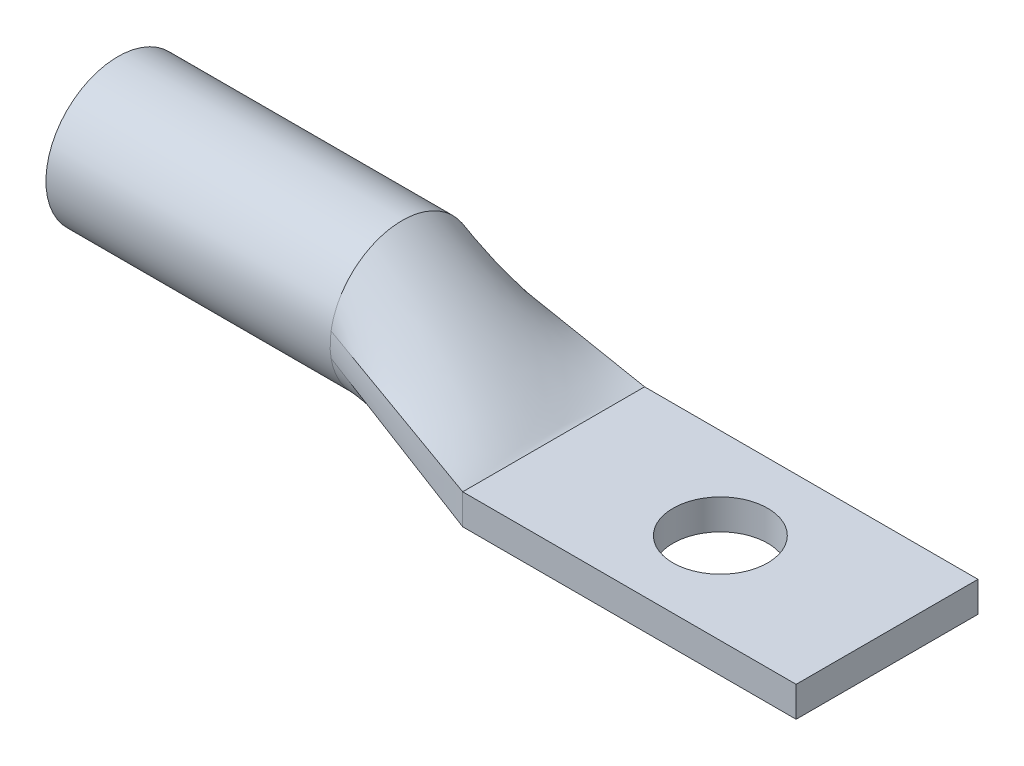
ISO-10303-21;
HEADER;
FILE_DESCRIPTION(('STEP AP214'),'2;1');
FILE_NAME('part.step','',(''),(''),'','','');
FILE_SCHEMA(('AUTOMOTIVE_DESIGN { 1 0 10303 214 1 1 1 1 }'));
ENDSEC;
DATA;
#1=APPLICATION_CONTEXT('core data for automotive mechanical design processes');
#2=APPLICATION_PROTOCOL_DEFINITION('international standard','automotive_design',2000,#1);
#3=PRODUCT_CONTEXT('',#1,'mechanical');
#4=PRODUCT('Part','Part','',(#3));
#5=PRODUCT_RELATED_PRODUCT_CATEGORY('part','',(#4));
#6=PRODUCT_DEFINITION_FORMATION('','',#4);
#7=PRODUCT_DEFINITION_CONTEXT('part definition',#1,'design');
#8=PRODUCT_DEFINITION('design','',#6,#7);
#9=PRODUCT_DEFINITION_SHAPE('','',#8);
#10=(LENGTH_UNIT() NAMED_UNIT(*) SI_UNIT(.MILLI.,.METRE.));
#11=(NAMED_UNIT(*) PLANE_ANGLE_UNIT() SI_UNIT($,.RADIAN.));
#12=(NAMED_UNIT(*) SI_UNIT($,.STERADIAN.) SOLID_ANGLE_UNIT());
#13=UNCERTAINTY_MEASURE_WITH_UNIT(LENGTH_MEASURE(1.E-05),#10,'distance_accuracy_value','');
#14=(GEOMETRIC_REPRESENTATION_CONTEXT(3) GLOBAL_UNCERTAINTY_ASSIGNED_CONTEXT((#13)) GLOBAL_UNIT_ASSIGNED_CONTEXT((#10,
#11,#12)) REPRESENTATION_CONTEXT('',''));
#15=CARTESIAN_POINT('',(0.,0.,0.));
#16=DIRECTION('',(0.,0.,1.));
#17=DIRECTION('',(1.,0.,0.));
#18=AXIS2_PLACEMENT_3D('',#15,#16,#17);
#19=CARTESIAN_POINT('',(19.05,0.,0.));
#20=DIRECTION('',(-1.,0.,0.));
#21=DIRECTION('',(0.,0.,1.));
#22=AXIS2_PLACEMENT_3D('',#19,#20,#21);
#23=CYLINDRICAL_SURFACE('',#22,4.826);
#24=CARTESIAN_POINT('',(19.05,0.793389512735654,-4.76033707641393));
#25=CARTESIAN_POINT('',(19.05,1.18468681003295,-4.69512086019771));
#26=CARTESIAN_POINT('',(19.05,1.61085234995865,-4.57504836332163));
#27=CARTESIAN_POINT('',(19.05,2.48972983893217,-4.16259031724598));
#28=CARTESIAN_POINT('',(19.05,2.9428198836875,-3.86831403633024));
#29=CARTESIAN_POINT('',(19.05,3.77274035984854,-3.06438779019007));
#30=CARTESIAN_POINT('',(19.05,4.14731721956046,-2.55250883358654));
#31=CARTESIAN_POINT('',(19.05,4.54385567654352,-1.65830273383458));
#32=CARTESIAN_POINT('',(19.05,4.6484134489801,-1.34016259708065));
#33=CARTESIAN_POINT('',(19.05,4.78953327401909,-0.681288776024551));
#34=CARTESIAN_POINT('',(19.05,4.826,-0.340686277378045));
#35=CARTESIAN_POINT('',(19.05,4.826,0.340686277378045));
#36=CARTESIAN_POINT('',(19.05,4.78953327401909,0.681288776024549));
#37=CARTESIAN_POINT('',(19.05,4.6484134489801,1.34016259708065));
#38=CARTESIAN_POINT('',(19.05,4.54385567654352,1.65830273383458));
#39=CARTESIAN_POINT('',(19.05,4.14731721956046,2.55250883358654));
#40=CARTESIAN_POINT('',(19.05,3.77274035984854,3.06438779019007));
#41=CARTESIAN_POINT('',(19.05,2.9428198836875,3.86831403633024));
#42=CARTESIAN_POINT('',(19.05,2.48972983893217,4.16259031724598));
#43=CARTESIAN_POINT('',(19.05,1.61085234995865,4.57504836332163));
#44=CARTESIAN_POINT('',(19.05,1.18468681003295,4.69512086019771));
#45=CARTESIAN_POINT('',(19.05,0.793389512735655,4.76033707641393));
#46=B_SPLINE_CURVE_WITH_KNOTS('',3,(#24,#25,#26,#27,#28,#29,#30,#31,#32,#33,#34,#35,#36,#37,#38,
#39,#40,#41,#42,#43,#44,#45),.UNSPECIFIED.,.F.,.F.,(4,2,2,2,2,2,2,2,2,2,4),(0.,0.125,0.25,0.375,
0.4375,0.5,0.5625,0.625,0.75,0.875,1.),.UNSPECIFIED.);
#47=CARTESIAN_POINT('',(19.05,0.793389512735655,-4.76033707641393));
#48=VERTEX_POINT('',#47);
#49=CARTESIAN_POINT('',(19.05,0.793391656333842,4.76034985110768));
#50=VERTEX_POINT('',#49);
#51=EDGE_CURVE('E13',#48,#50,#46,.T.);
#52=ORIENTED_EDGE('',*,*,#51,.F.);
#53=CARTESIAN_POINT('',(19.0499999999992,-0.793389530404539,-4.76033707346888));
#54=CARTESIAN_POINT('',(19.0499999553236,-0.70971940892889,-4.77428428292741));
#55=CARTESIAN_POINT('',(19.050313283054,-0.625682963095867,-4.78602102616122));
#56=CARTESIAN_POINT('',(19.0511964116202,-0.457106966634893,-4.80505138351904));
#57=CARTESIAN_POINT('',(19.0517662204116,-0.372567400481545,-4.81234485980635));
#58=CARTESIAN_POINT('',(19.0528223453544,-0.198209054157865,-4.82276508467764));
#59=CARTESIAN_POINT('',(19.0533017249978,-0.10837392405302,-4.8256197096395));
#60=CARTESIAN_POINT('',(19.0537578511973,0.0713231323465182,-4.82630917731358));
#61=CARTESIAN_POINT('',(19.0537345924902,0.161185058911953,-4.82414396746164));
#62=CARTESIAN_POINT('',(19.0532343312005,0.296344132059458,-4.8171077835285));
#63=CARTESIAN_POINT('',(19.0529869402001,0.341746553379283,-4.81409967309325));
#64=CARTESIAN_POINT('',(19.0523761546005,0.432448906192598,-4.80680077283046));
#65=CARTESIAN_POINT('',(19.052012759414,0.477748837166023,-4.80250997650884));
#66=CARTESIAN_POINT('',(19.0512534752478,0.568210320025473,-4.79264887790791));
#67=CARTESIAN_POINT('',(19.0508575851155,0.613371866944239,-4.7870785302322));
#68=CARTESIAN_POINT('',(19.0502432393321,0.703520288257333,-4.77466289335629));
#69=CARTESIAN_POINT('',(19.0500247830931,0.748507163229855,-4.76781760838003));
#70=CARTESIAN_POINT('',(19.05,0.793389512735655,-4.76033707641393));
#71=B_SPLINE_CURVE_WITH_KNOTS('',3,(#53,#54,#55,#56,#57,#58,#59,#60,#61,#62,#63,#64,#65,#66,#67,
#68,#69,#70),.UNSPECIFIED.,.F.,.F.,(4,2,2,2,2,2,2,2,4),(0.,0.254440838803736,0.508889570336781,
0.778396220456408,1.04790569267245,1.18439838796632,1.32089177431771,1.45739000398038,
1.59388778142562),.UNSPECIFIED.);
#72=CARTESIAN_POINT('',(19.05,-0.793391849598439,-4.76035098860972));
#73=VERTEX_POINT('',#72);
#74=EDGE_CURVE('E78',#73,#48,#71,.T.);
#75=ORIENTED_EDGE('',*,*,#74,.F.);
#76=CARTESIAN_POINT('',(19.05,0.,0.));
#77=DIRECTION('',(1.,0.,0.));
#78=DIRECTION('',(0.,0.,-1.));
#79=AXIS2_PLACEMENT_3D('',#76,#77,#78);
#80=CIRCLE('',#79,4.826);
#81=CARTESIAN_POINT('',(19.05,-0.793390031725335,4.76034008807513));
#82=VERTEX_POINT('',#81);
#83=EDGE_CURVE('E82',#82,#73,#80,.T.);
#84=ORIENTED_EDGE('',*,*,#83,.F.);
#85=CARTESIAN_POINT('',(19.05,0.793389526826757,4.76033707406541));
#86=CARTESIAN_POINT('',(19.0500192082532,0.751553142443878,4.76730990862543));
#87=CARTESIAN_POINT('',(19.0502115622753,0.709625926892214,4.7737308308762));
#88=CARTESIAN_POINT('',(19.05076404498,0.625618044641488,4.78546513617494));
#89=CARTESIAN_POINT('',(19.0511241726152,0.583537378902092,4.79077852613729));
#90=CARTESIAN_POINT('',(19.0518336922892,0.499250056063873,4.80029416520852));
#91=CARTESIAN_POINT('',(19.0521830842699,0.45704339828372,4.80449640829759));
#92=CARTESIAN_POINT('',(19.0527933583929,0.372534409972693,4.81178689971965));
#93=CARTESIAN_POINT('',(19.0530542402312,0.330232079113643,4.81487514422558));
#94=CARTESIAN_POINT('',(19.0536592548741,0.198212538373395,4.82276447994064));
#95=CARTESIAN_POINT('',(19.053770281145,0.108369498135098,4.82561943858651));
#96=CARTESIAN_POINT('',(19.0534515060578,-0.0713307979335069,4.82630949478189));
#97=CARTESIAN_POINT('',(19.0530216913107,-0.161188054060678,4.82414446805582));
#98=CARTESIAN_POINT('',(19.051969904612,-0.341787322490946,4.81474141245036));
#99=CARTESIAN_POINT('',(19.0513455502482,-0.432525990303786,4.80743899161503));
#100=CARTESIAN_POINT('',(19.0503610245987,-0.613447257436715,4.78771832679719));
#101=CARTESIAN_POINT('',(19.0500008544522,-0.703629854357454,4.77530006075634));
#102=CARTESIAN_POINT('',(19.05,-0.793389529321084,4.76033707364969));
#103=B_SPLINE_CURVE_WITH_KNOTS('',3,(#85,#86,#87,#88,#89,#90,#91,#92,#93,#94,#95,#96,#97,#98,
#99,#100,#101,#102),.UNSPECIFIED.,.F.,.F.,(4,2,2,2,2,2,2,2,4),(0.,0.127234934895088,
0.25446907543118,0.381703905263918,0.508939172197092,0.778448562686817,1.04796462526658,
1.32092040853963,1.59387736874754),.UNSPECIFIED.);
#104=EDGE_CURVE('E154',#50,#82,#103,.T.);
#105=ORIENTED_EDGE('',*,*,#104,.F.);
#106=EDGE_LOOP('',(#52,#75,#84,#105));
#107=FACE_BOUND('',#106,.T.);
#108=CARTESIAN_POINT('',(0.,0.,0.));
#109=DIRECTION('',(1.,0.,0.));
#110=DIRECTION('',(0.,0.,-1.));
#111=AXIS2_PLACEMENT_3D('',#108,#109,#110);
#112=CIRCLE('',#111,4.826);
#113=CARTESIAN_POINT('',(0.,0.,-4.826));
#114=VERTEX_POINT('',#113);
#115=EDGE_CURVE('E71',#114,#114,#112,.T.);
#116=ORIENTED_EDGE('',*,*,#115,.T.);
#117=EDGE_LOOP('',(#116));
#118=FACE_BOUND('',#117,.T.);
#119=ADVANCED_FACE('F62',(#107,#118),#23,.T.);
#120=CARTESIAN_POINT('',(0.,0.,0.));
#121=DIRECTION('',(1.,0.,0.));
#122=DIRECTION('',(0.,0.,-1.));
#123=AXIS2_PLACEMENT_3D('',#120,#121,#122);
#124=PLANE('',#123);
#125=CARTESIAN_POINT('',(0.,0.,0.));
#126=DIRECTION('',(-1.,0.,0.));
#127=DIRECTION('',(0.,0.,1.));
#128=AXIS2_PLACEMENT_3D('',#125,#126,#127);
#129=CIRCLE('',#128,3.556);
#130=CARTESIAN_POINT('',(0.,0.,3.556));
#131=VERTEX_POINT('',#130);
#132=EDGE_CURVE('E477',#131,#131,#129,.T.);
#133=ORIENTED_EDGE('',*,*,#132,.F.);
#134=EDGE_LOOP('',(#133));
#135=FACE_BOUND('',#134,.T.);
#136=ORIENTED_EDGE('',*,*,#115,.F.);
#137=EDGE_LOOP('',(#136));
#138=FACE_BOUND('',#137,.T.);
#139=ADVANCED_FACE('F177',(#135,#138),#124,.F.);
#140=CARTESIAN_POINT('',(19.05,0.793389512735655,4.76033707641393));
#141=CARTESIAN_POINT('',(29.21,-2.794,6.096));
#142=CARTESIAN_POINT('',(19.05,0.53252464787079,4.8038145538914));
#143=CARTESIAN_POINT('',(29.21,-3.13266666666667,6.096));
#144=CARTESIAN_POINT('',(19.05,0.266262323935395,4.82555329263014));
#145=CARTESIAN_POINT('',(29.21,-3.47133333333333,6.096));
#146=CARTESIAN_POINT('',(19.05,-0.266262323935394,4.82555329263014));
#147=CARTESIAN_POINT('',(29.21,-4.14866666666667,6.096));
#148=CARTESIAN_POINT('',(19.05,-0.532524647870789,4.8038145538914));
#149=CARTESIAN_POINT('',(29.21,-4.48733333333333,6.096));
#150=CARTESIAN_POINT('',(19.05,-0.793389512735654,4.76033707641393));
#151=CARTESIAN_POINT('',(29.21,-4.826,6.096));
#152=CARTESIAN_POINT('',(19.05,-0.798606810032951,4.75946752686438));
#153=CARTESIAN_POINT('',(29.21,-4.83277333333333,6.096));
#154=CARTESIAN_POINT('',(19.05,-0.803824107330249,4.75859797731483));
#155=CARTESIAN_POINT('',(29.21,-4.83954666666667,6.096));
#156=CARTESIAN_POINT('',(19.05,-0.809041404627546,4.75772842776528));
#157=CARTESIAN_POINT('',(29.21,-4.84632,6.096));
#158=B_SPLINE_SURFACE_WITH_KNOTS('',3,1,((#140,#141),(#142,#143),(#144,#145),(#146,#147),(#148,
#149),(#150,#151),(#152,#153),(#154,#155),(#156,#157)),.UNSPECIFIED.,.F.,.F.,.F.,(4,2,3,4),(2,
2),(0.,0.5,1.,1.01),(0.,1.),.UNSPECIFIED.);
#159=DIRECTION('',(0.922601713042873,-0.366190289722907,0.121287883990981));
#160=VECTOR('',#159,1.);
#161=CARTESIAN_POINT('',(24.13,-2.80969475636783,5.42816853820696));
#162=LINE('',#161,#160);
#163=CARTESIAN_POINT('',(29.21,-4.826,6.096));
#164=VERTEX_POINT('',#163);
#165=EDGE_CURVE('E211',#82,#164,#162,.T.);
#166=DIRECTION('',(0.,1.,0.));
#167=VECTOR('',#166,1.);
#168=CARTESIAN_POINT('',(29.21,-4.826,6.096));
#169=LINE('',#168,#167);
#170=CARTESIAN_POINT('',(29.21,-2.794,6.096));
#171=VERTEX_POINT('',#170);
#172=EDGE_CURVE('E219',#164,#171,#169,.T.);
#173=DIRECTION('',(-0.935783885153291,0.330415481868695,-0.123020850382734));
#174=VECTOR('',#173,1.);
#175=CARTESIAN_POINT('',(24.13,-1.00030524363217,5.42816853820696));
#176=LINE('',#175,#174);
#177=EDGE_CURVE('E157',#171,#50,#176,.T.);
#178=ORIENTED_EDGE('',*,*,#104,.T.);
#179=ORIENTED_EDGE('',*,*,#165,.T.);
#180=ORIENTED_EDGE('',*,*,#172,.T.);
#181=ORIENTED_EDGE('',*,*,#177,.T.);
#182=EDGE_LOOP('',(#178,#179,#180,#181));
#183=FACE_BOUND('',#182,.T.);
#184=ADVANCED_FACE('F225',(#183),#158,.T.);
#185=CARTESIAN_POINT('',(19.05,-0.793389512735654,4.76033707641393));
#186=CARTESIAN_POINT('',(29.21,-4.826,6.096));
#187=CARTESIAN_POINT('',(19.05,-1.18468681003295,4.69512086019771));
#188=CARTESIAN_POINT('',(29.21,-4.826,5.588));
#189=CARTESIAN_POINT('',(19.05,-1.61085234995865,4.57504836332163));
#190=CARTESIAN_POINT('',(29.21,-4.826,5.08));
#191=CARTESIAN_POINT('',(19.05,-2.48972983893217,4.16259031724599));
#192=CARTESIAN_POINT('',(29.21,-4.826,4.064));
#193=CARTESIAN_POINT('',(19.05,-2.9428198836875,3.86831403633024));
#194=CARTESIAN_POINT('',(29.21,-4.826,3.556));
#195=CARTESIAN_POINT('',(19.05,-3.77274035984854,3.06438779019007));
#196=CARTESIAN_POINT('',(29.21,-4.826,2.54000000000001));
#197=CARTESIAN_POINT('',(19.05,-4.14731721956046,2.55250883358654));
#198=CARTESIAN_POINT('',(29.21,-4.826,2.03200000000001));
#199=CARTESIAN_POINT('',(19.05,-4.54385567654352,1.65830273383458));
#200=CARTESIAN_POINT('',(29.21,-4.826,1.27000000000001));
#201=CARTESIAN_POINT('',(19.05,-4.6484134489801,1.34016259708065));
#202=CARTESIAN_POINT('',(29.21,-4.826,1.01600000000001));
#203=CARTESIAN_POINT('',(19.05,-4.78953327401909,0.681288776024551));
#204=CARTESIAN_POINT('',(29.21,-4.826,0.508000000000007));
#205=CARTESIAN_POINT('',(19.05,-4.826,0.340686277378046));
#206=CARTESIAN_POINT('',(29.21,-4.826,0.254000000000007));
#207=CARTESIAN_POINT('',(19.05,-4.826,-0.340686277378043));
#208=CARTESIAN_POINT('',(29.21,-4.826,-0.253999999999993));
#209=CARTESIAN_POINT('',(19.05,-4.78953327401909,-0.681288776024548));
#210=CARTESIAN_POINT('',(29.21,-4.826,-0.507999999999992));
#211=CARTESIAN_POINT('',(19.05,-4.6484134489801,-1.34016259708065));
#212=CARTESIAN_POINT('',(29.21,-4.826,-1.01599999999999));
#213=CARTESIAN_POINT('',(19.05,-4.54385567654352,-1.65830273383458));
#214=CARTESIAN_POINT('',(29.21,-4.826,-1.26999999999999));
#215=CARTESIAN_POINT('',(19.05,-4.14731721956046,-2.55250883358654));
#216=CARTESIAN_POINT('',(29.21,-4.826,-2.03199999999999));
#217=CARTESIAN_POINT('',(19.05,-3.77274035984854,-3.06438779019007));
#218=CARTESIAN_POINT('',(29.21,-4.826,-2.53999999999999));
#219=CARTESIAN_POINT('',(19.05,-2.9428198836875,-3.86831403633024));
#220=CARTESIAN_POINT('',(29.21,-4.826,-3.55599999999999));
#221=CARTESIAN_POINT('',(19.05,-2.48972983893217,-4.16259031724599));
#222=CARTESIAN_POINT('',(29.21,-4.826,-4.06399999999999));
#223=CARTESIAN_POINT('',(19.05,-1.61085234995865,-4.57504836332163));
#224=CARTESIAN_POINT('',(29.21,-4.826,-5.07999999999999));
#225=CARTESIAN_POINT('',(19.05,-1.18468681003295,-4.69512086019771));
#226=CARTESIAN_POINT('',(29.21,-4.826,-5.588));
#227=CARTESIAN_POINT('',(19.05,-0.793389512735656,-4.76033707641392));
#228=CARTESIAN_POINT('',(29.21,-4.826,-6.096));
#229=B_SPLINE_SURFACE_WITH_KNOTS('',3,1,((#185,#186),(#187,#188),(#189,#190),(#191,#192),(#193,
#194),(#195,#196),(#197,#198),(#199,#200),(#201,#202),(#203,#204),(#205,#206),(#207,#208),(#209,
#210),(#211,#212),(#213,#214),(#215,#216),(#217,#218),(#219,#220),(#221,#222),(#223,#224),(#225,
#226),(#227,#228)),.UNSPECIFIED.,.F.,.F.,.F.,(4,2,2,2,2,2,2,2,2,2,4),(2,2),(0.,0.125,0.25,0.375,
0.4375,0.5,0.5625,0.625,0.75,0.875,1.),(0.,1.),.UNSPECIFIED.);
#230=DIRECTION('',(0.922601713042873,-0.366190289722907,-0.121287883990981));
#231=VECTOR('',#230,1.);
#232=CARTESIAN_POINT('',(24.13,-2.80969475636783,-5.42816853820696));
#233=LINE('',#232,#231);
#234=CARTESIAN_POINT('',(29.21,-4.826,-6.096));
#235=VERTEX_POINT('',#234);
#236=EDGE_CURVE('E150',#73,#235,#233,.T.);
#237=DIRECTION('',(0.,0.,-1.));
#238=VECTOR('',#237,1.);
#239=CARTESIAN_POINT('',(29.21,-4.826,6.096));
#240=LINE('',#239,#238);
#241=EDGE_CURVE('E284',#164,#235,#240,.T.);
#242=ORIENTED_EDGE('',*,*,#83,.T.);
#243=ORIENTED_EDGE('',*,*,#236,.T.);
#244=ORIENTED_EDGE('',*,*,#241,.F.);
#245=ORIENTED_EDGE('',*,*,#165,.F.);
#246=EDGE_LOOP('',(#242,#243,#244,#245));
#247=FACE_BOUND('',#246,.T.);
#248=ADVANCED_FACE('F236',(#247),#229,.T.);
#249=CARTESIAN_POINT('',(19.05,0.793389512735654,-4.76033707641393));
#250=CARTESIAN_POINT('',(29.21,-2.794,-6.096));
#251=CARTESIAN_POINT('',(19.05,1.18468681003295,-4.69512086019771));
#252=CARTESIAN_POINT('',(29.21,-2.794,-5.588));
#253=CARTESIAN_POINT('',(19.05,1.61085234995865,-4.57504836332163));
#254=CARTESIAN_POINT('',(29.21,-2.794,-5.08));
#255=CARTESIAN_POINT('',(19.05,2.48972983893217,-4.16259031724598));
#256=CARTESIAN_POINT('',(29.21,-2.794,-4.064));
#257=CARTESIAN_POINT('',(19.05,2.9428198836875,-3.86831403633024));
#258=CARTESIAN_POINT('',(29.21,-2.794,-3.556));
#259=CARTESIAN_POINT('',(19.05,3.77274035984854,-3.06438779019007));
#260=CARTESIAN_POINT('',(29.21,-2.794,-2.54));
#261=CARTESIAN_POINT('',(19.05,4.14731721956046,-2.55250883358654));
#262=CARTESIAN_POINT('',(29.21,-2.794,-2.032));
#263=CARTESIAN_POINT('',(19.05,4.54385567654352,-1.65830273383458));
#264=CARTESIAN_POINT('',(29.21,-2.794,-1.27000000000001));
#265=CARTESIAN_POINT('',(19.05,4.6484134489801,-1.34016259708065));
#266=CARTESIAN_POINT('',(29.21,-2.794,-1.01600000000001));
#267=CARTESIAN_POINT('',(19.05,4.78953327401909,-0.681288776024551));
#268=CARTESIAN_POINT('',(29.21,-2.794,-0.508000000000005));
#269=CARTESIAN_POINT('',(19.05,4.826,-0.340686277378045));
#270=CARTESIAN_POINT('',(29.21,-2.794,-0.254000000000004));
#271=CARTESIAN_POINT('',(19.05,4.826,0.340686277378045));
#272=CARTESIAN_POINT('',(29.21,-2.794,0.253999999999996));
#273=CARTESIAN_POINT('',(19.05,4.78953327401909,0.681288776024549));
#274=CARTESIAN_POINT('',(29.21,-2.794,0.507999999999994));
#275=CARTESIAN_POINT('',(19.05,4.6484134489801,1.34016259708065));
#276=CARTESIAN_POINT('',(29.21,-2.794,1.01599999999999));
#277=CARTESIAN_POINT('',(19.05,4.54385567654352,1.65830273383458));
#278=CARTESIAN_POINT('',(29.21,-2.794,1.26999999999999));
#279=CARTESIAN_POINT('',(19.05,4.14731721956046,2.55250883358654));
#280=CARTESIAN_POINT('',(29.21,-2.794,2.03199999999999));
#281=CARTESIAN_POINT('',(19.05,3.77274035984854,3.06438779019007));
#282=CARTESIAN_POINT('',(29.21,-2.794,2.53999999999999));
#283=CARTESIAN_POINT('',(19.05,2.9428198836875,3.86831403633024));
#284=CARTESIAN_POINT('',(29.21,-2.794,3.556));
#285=CARTESIAN_POINT('',(19.05,2.48972983893217,4.16259031724598));
#286=CARTESIAN_POINT('',(29.21,-2.794,4.064));
#287=CARTESIAN_POINT('',(19.05,1.61085234995865,4.57504836332163));
#288=CARTESIAN_POINT('',(29.21,-2.794,5.08));
#289=CARTESIAN_POINT('',(19.05,1.18468681003295,4.69512086019771));
#290=CARTESIAN_POINT('',(29.21,-2.794,5.588));
#291=CARTESIAN_POINT('',(19.05,0.793389512735655,4.76033707641393));
#292=CARTESIAN_POINT('',(29.21,-2.794,6.096));
#293=B_SPLINE_SURFACE_WITH_KNOTS('',3,1,((#249,#250),(#251,#252),(#253,#254),(#255,#256),(#257,
#258),(#259,#260),(#261,#262),(#263,#264),(#265,#266),(#267,#268),(#269,#270),(#271,#272),(#273,
#274),(#275,#276),(#277,#278),(#279,#280),(#281,#282),(#283,#284),(#285,#286),(#287,#288),(#289,
#290),(#291,#292)),.UNSPECIFIED.,.F.,.F.,.F.,(4,2,2,2,2,2,2,2,2,2,4),(2,2),(0.,0.125,0.25,0.375,
0.4375,0.5,0.5625,0.625,0.75,0.875,1.),(0.,1.),.UNSPECIFIED.);
#294=DIRECTION('',(0.,0.,-1.));
#295=VECTOR('',#294,1.);
#296=CARTESIAN_POINT('',(29.21,-2.794,6.096));
#297=LINE('',#296,#295);
#298=CARTESIAN_POINT('',(29.21,-2.794,-6.096));
#299=VERTEX_POINT('',#298);
#300=EDGE_CURVE('E199',#171,#299,#297,.T.);
#301=DIRECTION('',(0.935783885153291,-0.330415481868695,-0.123020850382734));
#302=VECTOR('',#301,1.);
#303=CARTESIAN_POINT('',(24.13,-1.00030524363217,-5.42816853820696));
#304=LINE('',#303,#302);
#305=EDGE_CURVE('E363',#48,#299,#304,.T.);
#306=ORIENTED_EDGE('',*,*,#51,.T.);
#307=ORIENTED_EDGE('',*,*,#177,.F.);
#308=ORIENTED_EDGE('',*,*,#300,.T.);
#309=ORIENTED_EDGE('',*,*,#305,.F.);
#310=EDGE_LOOP('',(#306,#307,#308,#309));
#311=FACE_BOUND('',#310,.T.);
#312=ADVANCED_FACE('F171',(#311),#293,.T.);
#313=CARTESIAN_POINT('',(19.05,-0.809041404627548,-4.75772842776528));
#314=CARTESIAN_POINT('',(29.21,-4.84632,-6.096));
#315=CARTESIAN_POINT('',(19.05,-0.80382410733025,-4.75859797731483));
#316=CARTESIAN_POINT('',(29.21,-4.83954666666667,-6.096));
#317=CARTESIAN_POINT('',(19.05,-0.798606810032953,-4.75946752686438));
#318=CARTESIAN_POINT('',(29.21,-4.83277333333333,-6.096));
#319=CARTESIAN_POINT('',(19.05,-0.793389512735656,-4.76033707641392));
#320=CARTESIAN_POINT('',(29.21,-4.826,-6.096));
#321=CARTESIAN_POINT('',(19.05,-0.532524647870791,-4.8038145538914));
#322=CARTESIAN_POINT('',(29.21,-4.48733333333333,-6.096));
#323=CARTESIAN_POINT('',(19.05,-0.266262323935396,-4.82555329263014));
#324=CARTESIAN_POINT('',(29.21,-4.14866666666667,-6.096));
#325=CARTESIAN_POINT('',(19.05,0.266262323935395,-4.82555329263014));
#326=CARTESIAN_POINT('',(29.21,-3.47133333333333,-6.096));
#327=CARTESIAN_POINT('',(19.05,0.53252464787079,-4.8038145538914));
#328=CARTESIAN_POINT('',(29.21,-3.13266666666667,-6.096));
#329=CARTESIAN_POINT('',(19.05,0.793389512735655,-4.76033707641393));
#330=CARTESIAN_POINT('',(29.21,-2.794,-6.096));
#331=B_SPLINE_SURFACE_WITH_KNOTS('',3,1,((#313,#314),(#315,#316),(#317,#318),(#319,#320),(#321,
#322),(#323,#324),(#325,#326),(#327,#328),(#329,#330)),.UNSPECIFIED.,.F.,.F.,.F.,(4,3,2,4),(2,
2),(-0.01,0.,0.5,1.),(0.,1.),.UNSPECIFIED.);
#332=DIRECTION('',(0.,1.,0.));
#333=VECTOR('',#332,1.);
#334=CARTESIAN_POINT('',(29.21,-4.826,-6.096));
#335=LINE('',#334,#333);
#336=EDGE_CURVE('E129',#235,#299,#335,.T.);
#337=ORIENTED_EDGE('',*,*,#74,.T.);
#338=ORIENTED_EDGE('',*,*,#305,.T.);
#339=ORIENTED_EDGE('',*,*,#336,.F.);
#340=ORIENTED_EDGE('',*,*,#236,.F.);
#341=EDGE_LOOP('',(#337,#338,#339,#340));
#342=FACE_BOUND('',#341,.T.);
#343=ADVANCED_FACE('F165',(#342),#331,.T.);
#344=CARTESIAN_POINT('',(51.562,0.,0.));
#345=DIRECTION('',(1.,0.,0.));
#346=DIRECTION('',(0.,0.,-1.));
#347=AXIS2_PLACEMENT_3D('',#344,#345,#346);
#348=PLANE('',#347);
#349=DIRECTION('',(0.,1.,0.));
#350=VECTOR('',#349,1.);
#351=CARTESIAN_POINT('',(51.562,-4.826,6.096));
#352=LINE('',#351,#350);
#353=CARTESIAN_POINT('',(51.562,-4.826,6.096));
#354=VERTEX_POINT('',#353);
#355=CARTESIAN_POINT('',(51.562,-2.794,6.096));
#356=VERTEX_POINT('',#355);
#357=EDGE_CURVE('E144',#354,#356,#352,.T.);
#358=ORIENTED_EDGE('',*,*,#357,.F.);
#359=DIRECTION('',(0.,0.,-1.));
#360=VECTOR('',#359,1.);
#361=CARTESIAN_POINT('',(51.562,-4.826,6.096));
#362=LINE('',#361,#360);
#363=CARTESIAN_POINT('',(51.562,-4.826,-6.096));
#364=VERTEX_POINT('',#363);
#365=EDGE_CURVE('E121',#354,#364,#362,.T.);
#366=ORIENTED_EDGE('',*,*,#365,.T.);
#367=DIRECTION('',(0.,1.,0.));
#368=VECTOR('',#367,1.);
#369=CARTESIAN_POINT('',(51.562,-4.826,-6.096));
#370=LINE('',#369,#368);
#371=CARTESIAN_POINT('',(51.562,-2.794,-6.096));
#372=VERTEX_POINT('',#371);
#373=EDGE_CURVE('E114',#364,#372,#370,.T.);
#374=ORIENTED_EDGE('',*,*,#373,.T.);
#375=DIRECTION('',(0.,0.,-1.));
#376=VECTOR('',#375,1.);
#377=CARTESIAN_POINT('',(51.562,-2.794,6.096));
#378=LINE('',#377,#376);
#379=EDGE_CURVE('E118',#356,#372,#378,.T.);
#380=ORIENTED_EDGE('',*,*,#379,.F.);
#381=EDGE_LOOP('',(#358,#366,#374,#380));
#382=FACE_BOUND('',#381,.T.);
#383=ADVANCED_FACE('F116',(#382),#348,.T.);
#384=CARTESIAN_POINT('',(115.484173461566,-2.794,6.096));
#385=DIRECTION('',(0.,1.,0.));
#386=DIRECTION('',(0.,0.,1.));
#387=AXIS2_PLACEMENT_3D('',#384,#385,#386);
#388=PLANE('',#387);
#389=CARTESIAN_POINT('',(40.386,-2.794,0.));
#390=DIRECTION('',(0.,1.,0.));
#391=DIRECTION('',(0.,0.,1.));
#392=AXIS2_PLACEMENT_3D('',#389,#390,#391);
#393=CIRCLE('',#392,3.175);
#394=CARTESIAN_POINT('',(40.386,-2.794,3.175));
#395=VERTEX_POINT('',#394);
#396=EDGE_CURVE('E142',#395,#395,#393,.T.);
#397=ORIENTED_EDGE('',*,*,#396,.F.);
#398=EDGE_LOOP('',(#397));
#399=FACE_BOUND('',#398,.T.);
#400=DIRECTION('',(-1.,0.,0.));
#401=VECTOR('',#400,1.);
#402=CARTESIAN_POINT('',(115.484173461566,-2.794,6.096));
#403=LINE('',#402,#401);
#404=EDGE_CURVE('E138',#356,#171,#403,.T.);
#405=ORIENTED_EDGE('',*,*,#404,.F.);
#406=ORIENTED_EDGE('',*,*,#379,.T.);
#407=DIRECTION('',(-1.,0.,0.));
#408=VECTOR('',#407,1.);
#409=CARTESIAN_POINT('',(115.484173461566,-2.794,-6.096));
#410=LINE('',#409,#408);
#411=EDGE_CURVE('E126',#372,#299,#410,.T.);
#412=ORIENTED_EDGE('',*,*,#411,.T.);
#413=ORIENTED_EDGE('',*,*,#300,.F.);
#414=EDGE_LOOP('',(#405,#406,#412,#413));
#415=FACE_BOUND('',#414,.T.);
#416=ADVANCED_FACE('F137',(#399,#415),#388,.T.);
#417=CARTESIAN_POINT('',(115.484173461566,-4.826,-6.096));
#418=DIRECTION('',(0.,0.,1.));
#419=DIRECTION('',(1.,0.,0.));
#420=AXIS2_PLACEMENT_3D('',#417,#418,#419);
#421=PLANE('',#420);
#422=ORIENTED_EDGE('',*,*,#373,.F.);
#423=DIRECTION('',(-1.,0.,0.));
#424=VECTOR('',#423,1.);
#425=CARTESIAN_POINT('',(115.484173461566,-4.826,-6.096));
#426=LINE('',#425,#424);
#427=EDGE_CURVE('E134',#364,#235,#426,.T.);
#428=ORIENTED_EDGE('',*,*,#427,.T.);
#429=ORIENTED_EDGE('',*,*,#336,.T.);
#430=ORIENTED_EDGE('',*,*,#411,.F.);
#431=EDGE_LOOP('',(#422,#428,#429,#430));
#432=FACE_BOUND('',#431,.T.);
#433=ADVANCED_FACE('F127',(#432),#421,.F.);
#434=CARTESIAN_POINT('',(115.484173461566,-4.826,6.096));
#435=DIRECTION('',(0.,1.,0.));
#436=DIRECTION('',(0.,0.,1.));
#437=AXIS2_PLACEMENT_3D('',#434,#435,#436);
#438=PLANE('',#437);
#439=CARTESIAN_POINT('',(40.386,-4.826,0.));
#440=DIRECTION('',(0.,1.,0.));
#441=DIRECTION('',(0.,0.,1.));
#442=AXIS2_PLACEMENT_3D('',#439,#440,#441);
#443=CIRCLE('',#442,3.175);
#444=CARTESIAN_POINT('',(40.386,-4.826,3.175));
#445=VERTEX_POINT('',#444);
#446=EDGE_CURVE('E66',#445,#445,#443,.T.);
#447=ORIENTED_EDGE('',*,*,#446,.T.);
#448=EDGE_LOOP('',(#447));
#449=FACE_BOUND('',#448,.T.);
#450=ORIENTED_EDGE('',*,*,#365,.F.);
#451=DIRECTION('',(-1.,0.,0.));
#452=VECTOR('',#451,1.);
#453=CARTESIAN_POINT('',(115.484173461566,-4.826,6.096));
#454=LINE('',#453,#452);
#455=EDGE_CURVE('E146',#354,#164,#454,.T.);
#456=ORIENTED_EDGE('',*,*,#455,.T.);
#457=ORIENTED_EDGE('',*,*,#241,.T.);
#458=ORIENTED_EDGE('',*,*,#427,.F.);
#459=EDGE_LOOP('',(#450,#456,#457,#458));
#460=FACE_BOUND('',#459,.T.);
#461=ADVANCED_FACE('F271',(#449,#460),#438,.F.);
#462=CARTESIAN_POINT('',(115.484173461566,-4.826,6.096));
#463=DIRECTION('',(0.,0.,1.));
#464=DIRECTION('',(1.,0.,0.));
#465=AXIS2_PLACEMENT_3D('',#462,#463,#464);
#466=PLANE('',#465);
#467=ORIENTED_EDGE('',*,*,#455,.F.);
#468=ORIENTED_EDGE('',*,*,#357,.T.);
#469=ORIENTED_EDGE('',*,*,#404,.T.);
#470=ORIENTED_EDGE('',*,*,#172,.F.);
#471=EDGE_LOOP('',(#467,#468,#469,#470));
#472=FACE_BOUND('',#471,.T.);
#473=ADVANCED_FACE('F303',(#472),#466,.T.);
#474=CARTESIAN_POINT('',(40.386,-4.836,0.));
#475=DIRECTION('',(0.,1.,0.));
#476=DIRECTION('',(0.,0.,1.));
#477=AXIS2_PLACEMENT_3D('',#474,#475,#476);
#478=CYLINDRICAL_SURFACE('',#477,3.175);
#479=ORIENTED_EDGE('',*,*,#396,.T.);
#480=EDGE_LOOP('',(#479));
#481=FACE_BOUND('',#480,.T.);
#482=ORIENTED_EDGE('',*,*,#446,.F.);
#483=EDGE_LOOP('',(#482));
#484=FACE_BOUND('',#483,.T.);
#485=ADVANCED_FACE('F312',(#481,#484),#478,.F.);
#486=CARTESIAN_POINT('',(19.05,0.,0.));
#487=DIRECTION('',(-1.,0.,0.));
#488=DIRECTION('',(0.,0.,1.));
#489=AXIS2_PLACEMENT_3D('',#486,#487,#488);
#490=CYLINDRICAL_SURFACE('',#489,3.556);
#491=CARTESIAN_POINT('',(19.05,0.,0.));
#492=DIRECTION('',(-1.,0.,0.));
#493=DIRECTION('',(0.,0.,1.));
#494=AXIS2_PLACEMENT_3D('',#491,#492,#493);
#495=CIRCLE('',#494,3.556);
#496=CARTESIAN_POINT('',(19.05,0.,3.556));
#497=VERTEX_POINT('',#496);
#498=EDGE_CURVE('E475',#497,#497,#495,.T.);
#499=ORIENTED_EDGE('',*,*,#498,.F.);
#500=EDGE_LOOP('',(#499));
#501=FACE_BOUND('',#500,.T.);
#502=ORIENTED_EDGE('',*,*,#132,.T.);
#503=EDGE_LOOP('',(#502));
#504=FACE_BOUND('',#503,.T.);
#505=ADVANCED_FACE('F315',(#501,#504),#490,.F.);
#506=CARTESIAN_POINT('',(19.05,0.,0.));
#507=DIRECTION('',(-1.,0.,0.));
#508=DIRECTION('',(0.,0.,1.));
#509=AXIS2_PLACEMENT_3D('',#506,#507,#508);
#510=PLANE('',#509);
#511=ORIENTED_EDGE('',*,*,#498,.T.);
#512=EDGE_LOOP('',(#511));
#513=FACE_BOUND('',#512,.T.);
#514=ADVANCED_FACE('F319',(#513),#510,.T.);
#515=CLOSED_SHELL('',(#119,#139,#184,#248,#312,#343,#383,#416,#433,#461,#473,#485,#505,#514));
#516=MANIFOLD_SOLID_BREP('B2',#515);
#517=ADVANCED_BREP_SHAPE_REPRESENTATION('',(#18,#516),#14);
#518=SHAPE_DEFINITION_REPRESENTATION(#9,#517);
ENDSEC;
END-ISO-10303-21;
